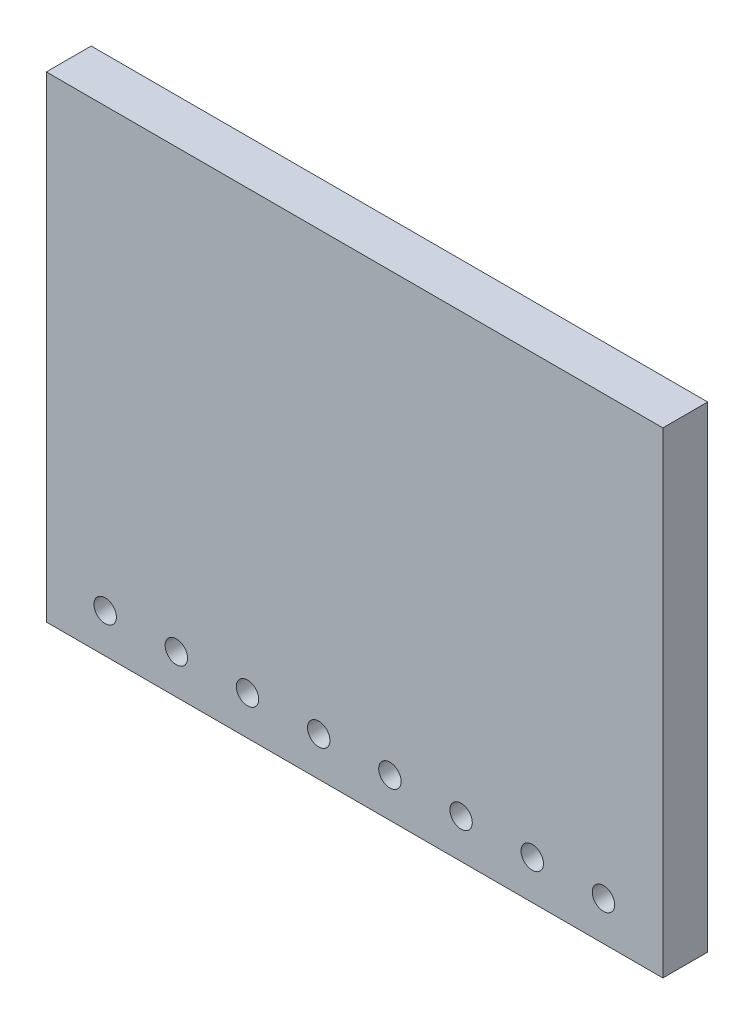
ISO-10303-21;
HEADER;
FILE_DESCRIPTION(('STEP AP214'),'2;1');
FILE_NAME('part.step','',(''),(''),'','','');
FILE_SCHEMA(('AUTOMOTIVE_DESIGN { 1 0 10303 214 1 1 1 1 }'));
ENDSEC;
DATA;
#1=APPLICATION_CONTEXT('core data for automotive mechanical design processes');
#2=APPLICATION_PROTOCOL_DEFINITION('international standard','automotive_design',2000,#1);
#3=PRODUCT_CONTEXT('',#1,'mechanical');
#4=PRODUCT('Part','Part','',(#3));
#5=PRODUCT_RELATED_PRODUCT_CATEGORY('part','',(#4));
#6=PRODUCT_DEFINITION_FORMATION('','',#4);
#7=PRODUCT_DEFINITION_CONTEXT('part definition',#1,'design');
#8=PRODUCT_DEFINITION('design','',#6,#7);
#9=PRODUCT_DEFINITION_SHAPE('','',#8);
#10=(LENGTH_UNIT() NAMED_UNIT(*) SI_UNIT(.MILLI.,.METRE.));
#11=(NAMED_UNIT(*) PLANE_ANGLE_UNIT() SI_UNIT($,.RADIAN.));
#12=(NAMED_UNIT(*) SI_UNIT($,.STERADIAN.) SOLID_ANGLE_UNIT());
#13=UNCERTAINTY_MEASURE_WITH_UNIT(LENGTH_MEASURE(1.E-05),#10,'distance_accuracy_value','');
#14=(GEOMETRIC_REPRESENTATION_CONTEXT(3) GLOBAL_UNCERTAINTY_ASSIGNED_CONTEXT((#13)) GLOBAL_UNIT_ASSIGNED_CONTEXT((#10,
#11,#12)) REPRESENTATION_CONTEXT('',''));
#15=CARTESIAN_POINT('',(0.,0.,0.));
#16=DIRECTION('',(0.,0.,1.));
#17=DIRECTION('',(1.,0.,0.));
#18=AXIS2_PLACEMENT_3D('',#15,#16,#17);
#19=CARTESIAN_POINT('',(-11.,8.5,1.6));
#20=DIRECTION('',(1.,0.,0.));
#21=DIRECTION('',(0.,1.,0.));
#22=AXIS2_PLACEMENT_3D('',#19,#20,#21);
#23=PLANE('',#22);
#24=DIRECTION('',(0.,-1.,0.));
#25=VECTOR('',#24,1.);
#26=CARTESIAN_POINT('',(-11.,8.5,0.));
#27=LINE('',#26,#25);
#28=CARTESIAN_POINT('',(-11.,8.5,0.));
#29=VERTEX_POINT('',#28);
#30=CARTESIAN_POINT('',(-11.,-8.5,0.));
#31=VERTEX_POINT('',#30);
#32=EDGE_CURVE('E102',#29,#31,#27,.T.);
#33=ORIENTED_EDGE('',*,*,#32,.T.);
#34=DIRECTION('',(0.,0.,-1.));
#35=VECTOR('',#34,1.);
#36=CARTESIAN_POINT('',(-11.,-8.5,1.6));
#37=LINE('',#36,#35);
#38=CARTESIAN_POINT('',(-11.,-8.5,1.6));
#39=VERTEX_POINT('',#38);
#40=EDGE_CURVE('E11',#39,#31,#37,.T.);
#41=ORIENTED_EDGE('',*,*,#40,.F.);
#42=DIRECTION('',(0.,-1.,0.));
#43=VECTOR('',#42,1.);
#44=CARTESIAN_POINT('',(-11.,8.5,1.6));
#45=LINE('',#44,#43);
#46=CARTESIAN_POINT('',(-11.,8.5,1.6));
#47=VERTEX_POINT('',#46);
#48=EDGE_CURVE('E90',#47,#39,#45,.T.);
#49=ORIENTED_EDGE('',*,*,#48,.F.);
#50=DIRECTION('',(0.,0.,-1.));
#51=VECTOR('',#50,1.);
#52=CARTESIAN_POINT('',(-11.,8.5,1.6));
#53=LINE('',#52,#51);
#54=EDGE_CURVE('E98',#47,#29,#53,.T.);
#55=ORIENTED_EDGE('',*,*,#54,.T.);
#56=EDGE_LOOP('',(#33,#41,#49,#55));
#57=FACE_BOUND('',#56,.T.);
#58=ADVANCED_FACE('F39',(#57),#23,.F.);
#59=CARTESIAN_POINT('',(11.,-8.5,1.6));
#60=DIRECTION('',(0.,1.,0.));
#61=DIRECTION('',(-1.,0.,0.));
#62=AXIS2_PLACEMENT_3D('',#59,#60,#61);
#63=PLANE('',#62);
#64=DIRECTION('',(1.,0.,0.));
#65=VECTOR('',#64,1.);
#66=CARTESIAN_POINT('',(11.,-8.5,0.));
#67=LINE('',#66,#65);
#68=CARTESIAN_POINT('',(11.,-8.5,0.));
#69=VERTEX_POINT('',#68);
#70=EDGE_CURVE('E94',#31,#69,#67,.T.);
#71=ORIENTED_EDGE('',*,*,#70,.T.);
#72=DIRECTION('',(0.,0.,-1.));
#73=VECTOR('',#72,1.);
#74=CARTESIAN_POINT('',(11.,-8.5,1.6));
#75=LINE('',#74,#73);
#76=CARTESIAN_POINT('',(11.,-8.5,1.6));
#77=VERTEX_POINT('',#76);
#78=EDGE_CURVE('E47',#77,#69,#75,.T.);
#79=ORIENTED_EDGE('',*,*,#78,.F.);
#80=DIRECTION('',(1.,0.,0.));
#81=VECTOR('',#80,1.);
#82=CARTESIAN_POINT('',(11.,-8.5,1.6));
#83=LINE('',#82,#81);
#84=EDGE_CURVE('E85',#39,#77,#83,.T.);
#85=ORIENTED_EDGE('',*,*,#84,.F.);
#86=ORIENTED_EDGE('',*,*,#40,.T.);
#87=EDGE_LOOP('',(#71,#79,#85,#86));
#88=FACE_BOUND('',#87,.T.);
#89=ADVANCED_FACE('F93',(#88),#63,.F.);
#90=CARTESIAN_POINT('',(11.,8.5,1.6));
#91=DIRECTION('',(-1.,0.,0.));
#92=DIRECTION('',(0.,-1.,0.));
#93=AXIS2_PLACEMENT_3D('',#90,#91,#92);
#94=PLANE('',#93);
#95=DIRECTION('',(0.,1.,0.));
#96=VECTOR('',#95,1.);
#97=CARTESIAN_POINT('',(11.,8.5,0.));
#98=LINE('',#97,#96);
#99=CARTESIAN_POINT('',(11.,8.5,0.));
#100=VERTEX_POINT('',#99);
#101=EDGE_CURVE('E72',#69,#100,#98,.T.);
#102=ORIENTED_EDGE('',*,*,#101,.T.);
#103=DIRECTION('',(0.,0.,-1.));
#104=VECTOR('',#103,1.);
#105=CARTESIAN_POINT('',(11.,8.5,1.6));
#106=LINE('',#105,#104);
#107=CARTESIAN_POINT('',(11.,8.5,1.6));
#108=VERTEX_POINT('',#107);
#109=EDGE_CURVE('E95',#108,#100,#106,.T.);
#110=ORIENTED_EDGE('',*,*,#109,.F.);
#111=DIRECTION('',(0.,1.,0.));
#112=VECTOR('',#111,1.);
#113=CARTESIAN_POINT('',(11.,8.5,1.6));
#114=LINE('',#113,#112);
#115=EDGE_CURVE('E88',#77,#108,#114,.T.);
#116=ORIENTED_EDGE('',*,*,#115,.F.);
#117=ORIENTED_EDGE('',*,*,#78,.T.);
#118=EDGE_LOOP('',(#102,#110,#116,#117));
#119=FACE_BOUND('',#118,.T.);
#120=ADVANCED_FACE('F96',(#119),#94,.F.);
#121=CARTESIAN_POINT('',(11.,8.5,1.6));
#122=DIRECTION('',(0.,-1.,0.));
#123=DIRECTION('',(1.,0.,0.));
#124=AXIS2_PLACEMENT_3D('',#121,#122,#123);
#125=PLANE('',#124);
#126=DIRECTION('',(-1.,0.,0.));
#127=VECTOR('',#126,1.);
#128=CARTESIAN_POINT('',(11.,8.5,0.));
#129=LINE('',#128,#127);
#130=EDGE_CURVE('E78',#100,#29,#129,.T.);
#131=ORIENTED_EDGE('',*,*,#130,.T.);
#132=ORIENTED_EDGE('',*,*,#54,.F.);
#133=DIRECTION('',(-1.,0.,0.));
#134=VECTOR('',#133,1.);
#135=CARTESIAN_POINT('',(11.,8.5,1.6));
#136=LINE('',#135,#134);
#137=EDGE_CURVE('E55',#108,#47,#136,.T.);
#138=ORIENTED_EDGE('',*,*,#137,.F.);
#139=ORIENTED_EDGE('',*,*,#109,.T.);
#140=EDGE_LOOP('',(#131,#132,#138,#139));
#141=FACE_BOUND('',#140,.T.);
#142=ADVANCED_FACE('F110',(#141),#125,.F.);
#143=CARTESIAN_POINT('',(0.,0.,1.6));
#144=DIRECTION('',(0.,0.,-1.));
#145=DIRECTION('',(-1.,0.,0.));
#146=AXIS2_PLACEMENT_3D('',#143,#144,#145);
#147=PLANE('',#146);
#148=CARTESIAN_POINT('',(-8.9,-7.1,1.6));
#149=DIRECTION('',(0.,0.,1.));
#150=DIRECTION('',(1.,0.,0.));
#151=AXIS2_PLACEMENT_3D('',#148,#149,#150);
#152=CIRCLE('',#151,0.4);
#153=CARTESIAN_POINT('',(-8.5,-7.1,1.6));
#154=VERTEX_POINT('',#153);
#155=EDGE_CURVE('E105',#154,#154,#152,.T.);
#156=ORIENTED_EDGE('',*,*,#155,.F.);
#157=EDGE_LOOP('',(#156));
#158=FACE_BOUND('',#157,.T.);
#159=CARTESIAN_POINT('',(-6.36,-7.10000000000001,1.6));
#160=DIRECTION('',(0.,0.,1.));
#161=DIRECTION('',(1.,0.,0.));
#162=AXIS2_PLACEMENT_3D('',#159,#160,#161);
#163=CIRCLE('',#162,0.4);
#164=CARTESIAN_POINT('',(-5.96,-7.10000000000001,1.6));
#165=VERTEX_POINT('',#164);
#166=EDGE_CURVE('E152',#165,#165,#163,.T.);
#167=ORIENTED_EDGE('',*,*,#166,.F.);
#168=EDGE_LOOP('',(#167));
#169=FACE_BOUND('',#168,.T.);
#170=CARTESIAN_POINT('',(-3.82,-7.10000000000001,1.6));
#171=DIRECTION('',(0.,0.,1.));
#172=DIRECTION('',(1.,0.,0.));
#173=AXIS2_PLACEMENT_3D('',#170,#171,#172);
#174=CIRCLE('',#173,0.4);
#175=CARTESIAN_POINT('',(-3.42,-7.10000000000001,1.6));
#176=VERTEX_POINT('',#175);
#177=EDGE_CURVE('E146',#176,#176,#174,.T.);
#178=ORIENTED_EDGE('',*,*,#177,.F.);
#179=EDGE_LOOP('',(#178));
#180=FACE_BOUND('',#179,.T.);
#181=CARTESIAN_POINT('',(-1.28,-7.10000000000001,1.6));
#182=DIRECTION('',(0.,0.,1.));
#183=DIRECTION('',(1.,0.,0.));
#184=AXIS2_PLACEMENT_3D('',#181,#182,#183);
#185=CIRCLE('',#184,0.4);
#186=CARTESIAN_POINT('',(-0.880000000000001,-7.10000000000001,1.6));
#187=VERTEX_POINT('',#186);
#188=EDGE_CURVE('E140',#187,#187,#185,.T.);
#189=ORIENTED_EDGE('',*,*,#188,.F.);
#190=EDGE_LOOP('',(#189));
#191=FACE_BOUND('',#190,.T.);
#192=CARTESIAN_POINT('',(1.26,-7.10000000000001,1.6));
#193=DIRECTION('',(0.,0.,1.));
#194=DIRECTION('',(1.,0.,0.));
#195=AXIS2_PLACEMENT_3D('',#192,#193,#194);
#196=CIRCLE('',#195,0.4);
#197=CARTESIAN_POINT('',(1.66,-7.10000000000001,1.6));
#198=VERTEX_POINT('',#197);
#199=EDGE_CURVE('E134',#198,#198,#196,.T.);
#200=ORIENTED_EDGE('',*,*,#199,.F.);
#201=EDGE_LOOP('',(#200));
#202=FACE_BOUND('',#201,.T.);
#203=CARTESIAN_POINT('',(3.8,-7.10000000000001,1.6));
#204=DIRECTION('',(0.,0.,1.));
#205=DIRECTION('',(1.,0.,0.));
#206=AXIS2_PLACEMENT_3D('',#203,#204,#205);
#207=CIRCLE('',#206,0.4);
#208=CARTESIAN_POINT('',(4.2,-7.10000000000001,1.6));
#209=VERTEX_POINT('',#208);
#210=EDGE_CURVE('E128',#209,#209,#207,.T.);
#211=ORIENTED_EDGE('',*,*,#210,.F.);
#212=EDGE_LOOP('',(#211));
#213=FACE_BOUND('',#212,.T.);
#214=CARTESIAN_POINT('',(6.34,-7.10000000000001,1.6));
#215=DIRECTION('',(0.,0.,1.));
#216=DIRECTION('',(1.,0.,0.));
#217=AXIS2_PLACEMENT_3D('',#214,#215,#216);
#218=CIRCLE('',#217,0.4);
#219=CARTESIAN_POINT('',(6.74,-7.10000000000001,1.6));
#220=VERTEX_POINT('',#219);
#221=EDGE_CURVE('E122',#220,#220,#218,.T.);
#222=ORIENTED_EDGE('',*,*,#221,.F.);
#223=EDGE_LOOP('',(#222));
#224=FACE_BOUND('',#223,.T.);
#225=CARTESIAN_POINT('',(8.88,-7.10000000000001,1.6));
#226=DIRECTION('',(0.,0.,1.));
#227=DIRECTION('',(1.,0.,0.));
#228=AXIS2_PLACEMENT_3D('',#225,#226,#227);
#229=CIRCLE('',#228,0.4);
#230=CARTESIAN_POINT('',(9.28,-7.10000000000001,1.6));
#231=VERTEX_POINT('',#230);
#232=EDGE_CURVE('E116',#231,#231,#229,.T.);
#233=ORIENTED_EDGE('',*,*,#232,.F.);
#234=EDGE_LOOP('',(#233));
#235=FACE_BOUND('',#234,.T.);
#236=ORIENTED_EDGE('',*,*,#48,.T.);
#237=ORIENTED_EDGE('',*,*,#84,.T.);
#238=ORIENTED_EDGE('',*,*,#115,.T.);
#239=ORIENTED_EDGE('',*,*,#137,.T.);
#240=EDGE_LOOP('',(#236,#237,#238,#239));
#241=FACE_BOUND('',#240,.T.);
#242=ADVANCED_FACE('F86',(#158,#169,#180,#191,#202,#213,#224,#235,#241),#147,.F.);
#243=CARTESIAN_POINT('',(0.,0.,0.));
#244=DIRECTION('',(0.,0.,-1.));
#245=DIRECTION('',(-1.,0.,0.));
#246=AXIS2_PLACEMENT_3D('',#243,#244,#245);
#247=PLANE('',#246);
#248=CARTESIAN_POINT('',(-8.9,-7.1,0.));
#249=DIRECTION('',(0.,0.,-1.));
#250=DIRECTION('',(-1.,0.,0.));
#251=AXIS2_PLACEMENT_3D('',#248,#249,#250);
#252=CIRCLE('',#251,0.4);
#253=CARTESIAN_POINT('',(-9.3,-7.1,0.));
#254=VERTEX_POINT('',#253);
#255=EDGE_CURVE('E158',#254,#254,#252,.F.);
#256=ORIENTED_EDGE('',*,*,#255,.T.);
#257=EDGE_LOOP('',(#256));
#258=FACE_BOUND('',#257,.T.);
#259=CARTESIAN_POINT('',(-6.36,-7.10000000000001,0.));
#260=DIRECTION('',(0.,0.,-1.));
#261=DIRECTION('',(-1.,0.,0.));
#262=AXIS2_PLACEMENT_3D('',#259,#260,#261);
#263=CIRCLE('',#262,0.4);
#264=CARTESIAN_POINT('',(-6.76,-7.10000000000001,0.));
#265=VERTEX_POINT('',#264);
#266=EDGE_CURVE('E155',#265,#265,#263,.F.);
#267=ORIENTED_EDGE('',*,*,#266,.T.);
#268=EDGE_LOOP('',(#267));
#269=FACE_BOUND('',#268,.T.);
#270=CARTESIAN_POINT('',(-3.82,-7.10000000000001,0.));
#271=DIRECTION('',(0.,0.,-1.));
#272=DIRECTION('',(-1.,0.,0.));
#273=AXIS2_PLACEMENT_3D('',#270,#271,#272);
#274=CIRCLE('',#273,0.4);
#275=CARTESIAN_POINT('',(-4.22,-7.10000000000001,0.));
#276=VERTEX_POINT('',#275);
#277=EDGE_CURVE('E149',#276,#276,#274,.F.);
#278=ORIENTED_EDGE('',*,*,#277,.T.);
#279=EDGE_LOOP('',(#278));
#280=FACE_BOUND('',#279,.T.);
#281=CARTESIAN_POINT('',(-1.28,-7.10000000000001,0.));
#282=DIRECTION('',(0.,0.,-1.));
#283=DIRECTION('',(-1.,0.,0.));
#284=AXIS2_PLACEMENT_3D('',#281,#282,#283);
#285=CIRCLE('',#284,0.4);
#286=CARTESIAN_POINT('',(-1.68,-7.10000000000001,0.));
#287=VERTEX_POINT('',#286);
#288=EDGE_CURVE('E143',#287,#287,#285,.F.);
#289=ORIENTED_EDGE('',*,*,#288,.T.);
#290=EDGE_LOOP('',(#289));
#291=FACE_BOUND('',#290,.T.);
#292=CARTESIAN_POINT('',(1.26,-7.10000000000001,0.));
#293=DIRECTION('',(0.,0.,-1.));
#294=DIRECTION('',(-1.,0.,0.));
#295=AXIS2_PLACEMENT_3D('',#292,#293,#294);
#296=CIRCLE('',#295,0.4);
#297=CARTESIAN_POINT('',(0.86,-7.10000000000001,0.));
#298=VERTEX_POINT('',#297);
#299=EDGE_CURVE('E137',#298,#298,#296,.F.);
#300=ORIENTED_EDGE('',*,*,#299,.T.);
#301=EDGE_LOOP('',(#300));
#302=FACE_BOUND('',#301,.T.);
#303=CARTESIAN_POINT('',(3.8,-7.10000000000001,0.));
#304=DIRECTION('',(0.,0.,-1.));
#305=DIRECTION('',(-1.,0.,0.));
#306=AXIS2_PLACEMENT_3D('',#303,#304,#305);
#307=CIRCLE('',#306,0.4);
#308=CARTESIAN_POINT('',(3.4,-7.10000000000001,0.));
#309=VERTEX_POINT('',#308);
#310=EDGE_CURVE('E131',#309,#309,#307,.F.);
#311=ORIENTED_EDGE('',*,*,#310,.T.);
#312=EDGE_LOOP('',(#311));
#313=FACE_BOUND('',#312,.T.);
#314=CARTESIAN_POINT('',(6.34,-7.10000000000001,0.));
#315=DIRECTION('',(0.,0.,-1.));
#316=DIRECTION('',(-1.,0.,0.));
#317=AXIS2_PLACEMENT_3D('',#314,#315,#316);
#318=CIRCLE('',#317,0.4);
#319=CARTESIAN_POINT('',(5.94,-7.10000000000001,0.));
#320=VERTEX_POINT('',#319);
#321=EDGE_CURVE('E125',#320,#320,#318,.F.);
#322=ORIENTED_EDGE('',*,*,#321,.T.);
#323=EDGE_LOOP('',(#322));
#324=FACE_BOUND('',#323,.T.);
#325=CARTESIAN_POINT('',(8.88,-7.10000000000001,0.));
#326=DIRECTION('',(0.,0.,-1.));
#327=DIRECTION('',(-1.,0.,0.));
#328=AXIS2_PLACEMENT_3D('',#325,#326,#327);
#329=CIRCLE('',#328,0.4);
#330=CARTESIAN_POINT('',(8.48,-7.10000000000001,0.));
#331=VERTEX_POINT('',#330);
#332=EDGE_CURVE('E119',#331,#331,#329,.F.);
#333=ORIENTED_EDGE('',*,*,#332,.T.);
#334=EDGE_LOOP('',(#333));
#335=FACE_BOUND('',#334,.T.);
#336=ORIENTED_EDGE('',*,*,#32,.F.);
#337=ORIENTED_EDGE('',*,*,#130,.F.);
#338=ORIENTED_EDGE('',*,*,#101,.F.);
#339=ORIENTED_EDGE('',*,*,#70,.F.);
#340=EDGE_LOOP('',(#336,#337,#338,#339));
#341=FACE_BOUND('',#340,.T.);
#342=ADVANCED_FACE('F113',(#258,#269,#280,#291,#302,#313,#324,#335,#341),#247,.T.);
#343=CARTESIAN_POINT('',(8.88,-7.10000000000001,-0.000999999999999916));
#344=DIRECTION('',(0.,0.,1.));
#345=DIRECTION('',(1.,0.,0.));
#346=AXIS2_PLACEMENT_3D('',#343,#344,#345);
#347=CYLINDRICAL_SURFACE('',#346,0.4);
#348=ORIENTED_EDGE('',*,*,#332,.F.);
#349=EDGE_LOOP('',(#348));
#350=FACE_BOUND('',#349,.T.);
#351=ORIENTED_EDGE('',*,*,#232,.T.);
#352=EDGE_LOOP('',(#351));
#353=FACE_BOUND('',#352,.T.);
#354=ADVANCED_FACE('F183',(#350,#353),#347,.F.);
#355=CARTESIAN_POINT('',(6.34,-7.10000000000001,-0.000999999999999916));
#356=DIRECTION('',(0.,0.,1.));
#357=DIRECTION('',(1.,0.,0.));
#358=AXIS2_PLACEMENT_3D('',#355,#356,#357);
#359=CYLINDRICAL_SURFACE('',#358,0.4);
#360=ORIENTED_EDGE('',*,*,#321,.F.);
#361=EDGE_LOOP('',(#360));
#362=FACE_BOUND('',#361,.T.);
#363=ORIENTED_EDGE('',*,*,#221,.T.);
#364=EDGE_LOOP('',(#363));
#365=FACE_BOUND('',#364,.T.);
#366=ADVANCED_FACE('F185',(#362,#365),#359,.F.);
#367=CARTESIAN_POINT('',(3.8,-7.10000000000001,-0.000999999999999916));
#368=DIRECTION('',(0.,0.,1.));
#369=DIRECTION('',(1.,0.,0.));
#370=AXIS2_PLACEMENT_3D('',#367,#368,#369);
#371=CYLINDRICAL_SURFACE('',#370,0.4);
#372=ORIENTED_EDGE('',*,*,#310,.F.);
#373=EDGE_LOOP('',(#372));
#374=FACE_BOUND('',#373,.T.);
#375=ORIENTED_EDGE('',*,*,#210,.T.);
#376=EDGE_LOOP('',(#375));
#377=FACE_BOUND('',#376,.T.);
#378=ADVANCED_FACE('F192',(#374,#377),#371,.F.);
#379=CARTESIAN_POINT('',(1.26,-7.10000000000001,-0.000999999999999916));
#380=DIRECTION('',(0.,0.,1.));
#381=DIRECTION('',(1.,0.,0.));
#382=AXIS2_PLACEMENT_3D('',#379,#380,#381);
#383=CYLINDRICAL_SURFACE('',#382,0.4);
#384=ORIENTED_EDGE('',*,*,#299,.F.);
#385=EDGE_LOOP('',(#384));
#386=FACE_BOUND('',#385,.T.);
#387=ORIENTED_EDGE('',*,*,#199,.T.);
#388=EDGE_LOOP('',(#387));
#389=FACE_BOUND('',#388,.T.);
#390=ADVANCED_FACE('F242',(#386,#389),#383,.F.);
#391=CARTESIAN_POINT('',(-1.28,-7.10000000000001,-0.000999999999999916));
#392=DIRECTION('',(0.,0.,1.));
#393=DIRECTION('',(1.,0.,0.));
#394=AXIS2_PLACEMENT_3D('',#391,#392,#393);
#395=CYLINDRICAL_SURFACE('',#394,0.4);
#396=ORIENTED_EDGE('',*,*,#288,.F.);
#397=EDGE_LOOP('',(#396));
#398=FACE_BOUND('',#397,.T.);
#399=ORIENTED_EDGE('',*,*,#188,.T.);
#400=EDGE_LOOP('',(#399));
#401=FACE_BOUND('',#400,.T.);
#402=ADVANCED_FACE('F252',(#398,#401),#395,.F.);
#403=CARTESIAN_POINT('',(-3.82,-7.10000000000001,-0.000999999999999916));
#404=DIRECTION('',(0.,0.,1.));
#405=DIRECTION('',(1.,0.,0.));
#406=AXIS2_PLACEMENT_3D('',#403,#404,#405);
#407=CYLINDRICAL_SURFACE('',#406,0.4);
#408=ORIENTED_EDGE('',*,*,#277,.F.);
#409=EDGE_LOOP('',(#408));
#410=FACE_BOUND('',#409,.T.);
#411=ORIENTED_EDGE('',*,*,#177,.T.);
#412=EDGE_LOOP('',(#411));
#413=FACE_BOUND('',#412,.T.);
#414=ADVANCED_FACE('F262',(#410,#413),#407,.F.);
#415=CARTESIAN_POINT('',(-6.36,-7.10000000000001,-0.000999999999999916));
#416=DIRECTION('',(0.,0.,1.));
#417=DIRECTION('',(1.,0.,0.));
#418=AXIS2_PLACEMENT_3D('',#415,#416,#417);
#419=CYLINDRICAL_SURFACE('',#418,0.4);
#420=ORIENTED_EDGE('',*,*,#266,.F.);
#421=EDGE_LOOP('',(#420));
#422=FACE_BOUND('',#421,.T.);
#423=ORIENTED_EDGE('',*,*,#166,.T.);
#424=EDGE_LOOP('',(#423));
#425=FACE_BOUND('',#424,.T.);
#426=ADVANCED_FACE('F272',(#422,#425),#419,.F.);
#427=CARTESIAN_POINT('',(-8.9,-7.1,-0.000999999999999916));
#428=DIRECTION('',(0.,0.,1.));
#429=DIRECTION('',(1.,0.,0.));
#430=AXIS2_PLACEMENT_3D('',#427,#428,#429);
#431=CYLINDRICAL_SURFACE('',#430,0.4);
#432=ORIENTED_EDGE('',*,*,#255,.F.);
#433=EDGE_LOOP('',(#432));
#434=FACE_BOUND('',#433,.T.);
#435=ORIENTED_EDGE('',*,*,#155,.T.);
#436=EDGE_LOOP('',(#435));
#437=FACE_BOUND('',#436,.T.);
#438=ADVANCED_FACE('F164',(#434,#437),#431,.F.);
#439=CLOSED_SHELL('',(#58,#89,#120,#142,#242,#342,#354,#366,#378,#390,#402,#414,#426,#438));
#440=MANIFOLD_SOLID_BREP('B2',#439);
#441=ADVANCED_BREP_SHAPE_REPRESENTATION('',(#18,#440),#14);
#442=SHAPE_DEFINITION_REPRESENTATION(#9,#441);
ENDSEC;
END-ISO-10303-21;
